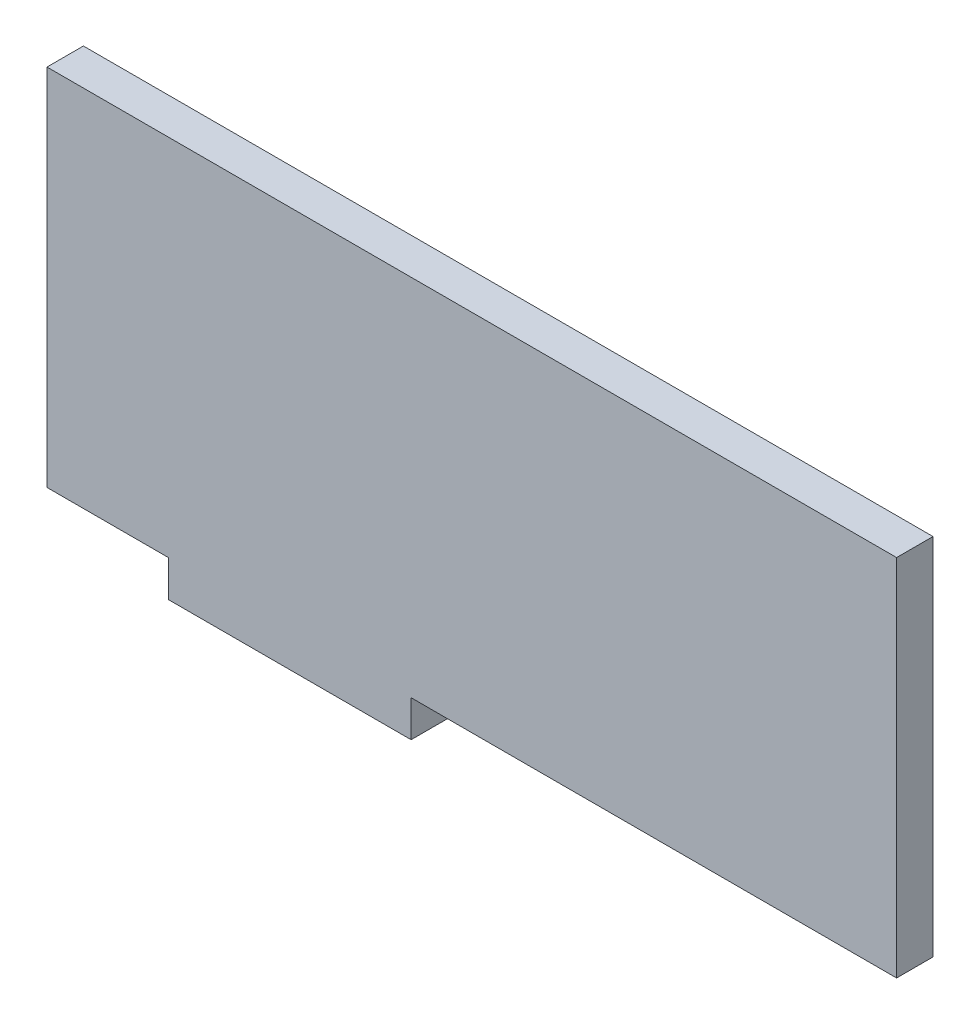
ISO-10303-21;
HEADER;
FILE_DESCRIPTION(('STEP AP214'),'2;1');
FILE_NAME('part.step','',(''),(''),'','','');
FILE_SCHEMA(('AUTOMOTIVE_DESIGN { 1 0 10303 214 1 1 1 1 }'));
ENDSEC;
DATA;
#1=APPLICATION_CONTEXT('core data for automotive mechanical design processes');
#2=APPLICATION_PROTOCOL_DEFINITION('international standard','automotive_design',2000,#1);
#3=PRODUCT_CONTEXT('',#1,'mechanical');
#4=PRODUCT('Part','Part','',(#3));
#5=PRODUCT_RELATED_PRODUCT_CATEGORY('part','',(#4));
#6=PRODUCT_DEFINITION_FORMATION('','',#4);
#7=PRODUCT_DEFINITION_CONTEXT('part definition',#1,'design');
#8=PRODUCT_DEFINITION('design','',#6,#7);
#9=PRODUCT_DEFINITION_SHAPE('','',#8);
#10=(LENGTH_UNIT() NAMED_UNIT(*) SI_UNIT(.MILLI.,.METRE.));
#11=(NAMED_UNIT(*) PLANE_ANGLE_UNIT() SI_UNIT($,.RADIAN.));
#12=(NAMED_UNIT(*) SI_UNIT($,.STERADIAN.) SOLID_ANGLE_UNIT());
#13=UNCERTAINTY_MEASURE_WITH_UNIT(LENGTH_MEASURE(1.E-05),#10,'distance_accuracy_value','');
#14=(GEOMETRIC_REPRESENTATION_CONTEXT(3) GLOBAL_UNCERTAINTY_ASSIGNED_CONTEXT((#13)) GLOBAL_UNIT_ASSIGNED_CONTEXT((#10,
#11,#12)) REPRESENTATION_CONTEXT('',''));
#15=CARTESIAN_POINT('',(0.,0.,0.));
#16=DIRECTION('',(0.,0.,1.));
#17=DIRECTION('',(1.,0.,0.));
#18=AXIS2_PLACEMENT_3D('',#15,#16,#17);
#19=CARTESIAN_POINT('',(0.,-3.00000000000001,3.));
#20=DIRECTION('',(1.,0.,0.));
#21=DIRECTION('',(0.,0.,-1.));
#22=AXIS2_PLACEMENT_3D('',#19,#20,#21);
#23=PLANE('',#22);
#24=DIRECTION('',(0.,-1.,0.));
#25=VECTOR('',#24,1.);
#26=CARTESIAN_POINT('',(0.,-3.00000000000001,0.));
#27=LINE('',#26,#25);
#28=CARTESIAN_POINT('',(0.,0.,0.));
#29=VERTEX_POINT('',#28);
#30=CARTESIAN_POINT('',(0.,-3.00000000000001,0.));
#31=VERTEX_POINT('',#30);
#32=EDGE_CURVE('E140',#29,#31,#27,.T.);
#33=ORIENTED_EDGE('',*,*,#32,.T.);
#34=DIRECTION('',(0.,0.,-1.));
#35=VECTOR('',#34,1.);
#36=CARTESIAN_POINT('',(0.,-3.00000000000001,3.));
#37=LINE('',#36,#35);
#38=CARTESIAN_POINT('',(0.,-3.00000000000001,3.));
#39=VERTEX_POINT('',#38);
#40=EDGE_CURVE('E11',#39,#31,#37,.T.);
#41=ORIENTED_EDGE('',*,*,#40,.F.);
#42=DIRECTION('',(0.,-1.,0.));
#43=VECTOR('',#42,1.);
#44=CARTESIAN_POINT('',(0.,-3.00000000000001,3.));
#45=LINE('',#44,#43);
#46=CARTESIAN_POINT('',(0.,0.,3.));
#47=VERTEX_POINT('',#46);
#48=EDGE_CURVE('E162',#47,#39,#45,.T.);
#49=ORIENTED_EDGE('',*,*,#48,.F.);
#50=DIRECTION('',(0.,0.,-1.));
#51=VECTOR('',#50,1.);
#52=CARTESIAN_POINT('',(0.,0.,3.));
#53=LINE('',#52,#51);
#54=EDGE_CURVE('E136',#47,#29,#53,.T.);
#55=ORIENTED_EDGE('',*,*,#54,.T.);
#56=EDGE_LOOP('',(#33,#41,#49,#55));
#57=FACE_BOUND('',#56,.T.);
#58=ADVANCED_FACE('F39',(#57),#23,.F.);
#59=CARTESIAN_POINT('',(20.,-3.00000000000001,3.));
#60=DIRECTION('',(0.,1.,0.));
#61=DIRECTION('',(-1.,0.,0.));
#62=AXIS2_PLACEMENT_3D('',#59,#60,#61);
#63=PLANE('',#62);
#64=DIRECTION('',(1.,0.,0.));
#65=VECTOR('',#64,1.);
#66=CARTESIAN_POINT('',(20.,-3.00000000000001,0.));
#67=LINE('',#66,#65);
#68=CARTESIAN_POINT('',(20.,-3.00000000000001,0.));
#69=VERTEX_POINT('',#68);
#70=EDGE_CURVE('E144',#31,#69,#67,.T.);
#71=ORIENTED_EDGE('',*,*,#70,.T.);
#72=DIRECTION('',(0.,0.,-1.));
#73=VECTOR('',#72,1.);
#74=CARTESIAN_POINT('',(20.,-3.00000000000001,3.));
#75=LINE('',#74,#73);
#76=CARTESIAN_POINT('',(20.,-3.00000000000001,3.));
#77=VERTEX_POINT('',#76);
#78=EDGE_CURVE('E48',#77,#69,#75,.T.);
#79=ORIENTED_EDGE('',*,*,#78,.F.);
#80=DIRECTION('',(1.,0.,0.));
#81=VECTOR('',#80,1.);
#82=CARTESIAN_POINT('',(20.,-3.00000000000001,3.));
#83=LINE('',#82,#81);
#84=EDGE_CURVE('E99',#39,#77,#83,.T.);
#85=ORIENTED_EDGE('',*,*,#84,.F.);
#86=ORIENTED_EDGE('',*,*,#40,.T.);
#87=EDGE_LOOP('',(#71,#79,#85,#86));
#88=FACE_BOUND('',#87,.T.);
#89=ADVANCED_FACE('F208',(#88),#63,.F.);
#90=CARTESIAN_POINT('',(20.,0.,3.));
#91=DIRECTION('',(-1.,0.,0.));
#92=DIRECTION('',(0.,-1.,0.));
#93=AXIS2_PLACEMENT_3D('',#90,#91,#92);
#94=PLANE('',#93);
#95=DIRECTION('',(0.,1.,0.));
#96=VECTOR('',#95,1.);
#97=CARTESIAN_POINT('',(20.,0.,0.));
#98=LINE('',#97,#96);
#99=CARTESIAN_POINT('',(20.,0.,0.));
#100=VERTEX_POINT('',#99);
#101=EDGE_CURVE('E147',#69,#100,#98,.T.);
#102=ORIENTED_EDGE('',*,*,#101,.T.);
#103=DIRECTION('',(0.,0.,-1.));
#104=VECTOR('',#103,1.);
#105=CARTESIAN_POINT('',(20.,0.,3.));
#106=LINE('',#105,#104);
#107=CARTESIAN_POINT('',(20.,0.,3.));
#108=VERTEX_POINT('',#107);
#109=EDGE_CURVE('E173',#108,#100,#106,.T.);
#110=ORIENTED_EDGE('',*,*,#109,.F.);
#111=DIRECTION('',(0.,1.,0.));
#112=VECTOR('',#111,1.);
#113=CARTESIAN_POINT('',(20.,0.,3.));
#114=LINE('',#113,#112);
#115=EDGE_CURVE('E183',#77,#108,#114,.T.);
#116=ORIENTED_EDGE('',*,*,#115,.F.);
#117=ORIENTED_EDGE('',*,*,#78,.T.);
#118=EDGE_LOOP('',(#102,#110,#116,#117));
#119=FACE_BOUND('',#118,.T.);
#120=ADVANCED_FACE('F181',(#119),#94,.F.);
#121=CARTESIAN_POINT('',(60.,0.,3.));
#122=DIRECTION('',(0.,1.,0.));
#123=DIRECTION('',(-1.,0.,0.));
#124=AXIS2_PLACEMENT_3D('',#121,#122,#123);
#125=PLANE('',#124);
#126=DIRECTION('',(1.,0.,0.));
#127=VECTOR('',#126,1.);
#128=CARTESIAN_POINT('',(60.,0.,0.));
#129=LINE('',#128,#127);
#130=CARTESIAN_POINT('',(60.,0.,0.));
#131=VERTEX_POINT('',#130);
#132=EDGE_CURVE('E150',#100,#131,#129,.T.);
#133=ORIENTED_EDGE('',*,*,#132,.T.);
#134=DIRECTION('',(0.,0.,-1.));
#135=VECTOR('',#134,1.);
#136=CARTESIAN_POINT('',(60.,0.,3.));
#137=LINE('',#136,#135);
#138=CARTESIAN_POINT('',(60.,0.,3.));
#139=VERTEX_POINT('',#138);
#140=EDGE_CURVE('E169',#139,#131,#137,.T.);
#141=ORIENTED_EDGE('',*,*,#140,.F.);
#142=DIRECTION('',(1.,0.,0.));
#143=VECTOR('',#142,1.);
#144=CARTESIAN_POINT('',(60.,0.,3.));
#145=LINE('',#144,#143);
#146=EDGE_CURVE('E196',#108,#139,#145,.T.);
#147=ORIENTED_EDGE('',*,*,#146,.F.);
#148=ORIENTED_EDGE('',*,*,#109,.T.);
#149=EDGE_LOOP('',(#133,#141,#147,#148));
#150=FACE_BOUND('',#149,.T.);
#151=ADVANCED_FACE('F191',(#150),#125,.F.);
#152=CARTESIAN_POINT('',(60.,30.,3.));
#153=DIRECTION('',(-1.,0.,0.));
#154=DIRECTION('',(0.,-1.,0.));
#155=AXIS2_PLACEMENT_3D('',#152,#153,#154);
#156=PLANE('',#155);
#157=DIRECTION('',(0.,1.,0.));
#158=VECTOR('',#157,1.);
#159=CARTESIAN_POINT('',(60.,30.,0.));
#160=LINE('',#159,#158);
#161=CARTESIAN_POINT('',(60.,30.,0.));
#162=VERTEX_POINT('',#161);
#163=EDGE_CURVE('E153',#131,#162,#160,.T.);
#164=ORIENTED_EDGE('',*,*,#163,.T.);
#165=DIRECTION('',(0.,0.,-1.));
#166=VECTOR('',#165,1.);
#167=CARTESIAN_POINT('',(60.,30.,3.));
#168=LINE('',#167,#166);
#169=CARTESIAN_POINT('',(60.,30.,3.));
#170=VERTEX_POINT('',#169);
#171=EDGE_CURVE('E129',#170,#162,#168,.T.);
#172=ORIENTED_EDGE('',*,*,#171,.F.);
#173=DIRECTION('',(0.,1.,0.));
#174=VECTOR('',#173,1.);
#175=CARTESIAN_POINT('',(60.,30.,3.));
#176=LINE('',#175,#174);
#177=EDGE_CURVE('E118',#139,#170,#176,.T.);
#178=ORIENTED_EDGE('',*,*,#177,.F.);
#179=ORIENTED_EDGE('',*,*,#140,.T.);
#180=EDGE_LOOP('',(#164,#172,#178,#179));
#181=FACE_BOUND('',#180,.T.);
#182=ADVANCED_FACE('F194',(#181),#156,.F.);
#183=CARTESIAN_POINT('',(-10.,30.,3.));
#184=DIRECTION('',(0.,-1.,0.));
#185=DIRECTION('',(1.,0.,0.));
#186=AXIS2_PLACEMENT_3D('',#183,#184,#185);
#187=PLANE('',#186);
#188=DIRECTION('',(-1.,0.,0.));
#189=VECTOR('',#188,1.);
#190=CARTESIAN_POINT('',(-10.,30.,0.));
#191=LINE('',#190,#189);
#192=CARTESIAN_POINT('',(-10.,30.,0.));
#193=VERTEX_POINT('',#192);
#194=EDGE_CURVE('E127',#162,#193,#191,.T.);
#195=ORIENTED_EDGE('',*,*,#194,.T.);
#196=DIRECTION('',(0.,0.,-1.));
#197=VECTOR('',#196,1.);
#198=CARTESIAN_POINT('',(-10.,30.,3.));
#199=LINE('',#198,#197);
#200=CARTESIAN_POINT('',(-10.,30.,3.));
#201=VERTEX_POINT('',#200);
#202=EDGE_CURVE('E124',#201,#193,#199,.T.);
#203=ORIENTED_EDGE('',*,*,#202,.F.);
#204=DIRECTION('',(-1.,0.,0.));
#205=VECTOR('',#204,1.);
#206=CARTESIAN_POINT('',(-10.,30.,3.));
#207=LINE('',#206,#205);
#208=EDGE_CURVE('E112',#170,#201,#207,.T.);
#209=ORIENTED_EDGE('',*,*,#208,.F.);
#210=ORIENTED_EDGE('',*,*,#171,.T.);
#211=EDGE_LOOP('',(#195,#203,#209,#210));
#212=FACE_BOUND('',#211,.T.);
#213=ADVANCED_FACE('F125',(#212),#187,.F.);
#214=CARTESIAN_POINT('',(-10.,0.,3.));
#215=DIRECTION('',(1.,0.,0.));
#216=DIRECTION('',(0.,0.,-1.));
#217=AXIS2_PLACEMENT_3D('',#214,#215,#216);
#218=PLANE('',#217);
#219=DIRECTION('',(0.,-1.,0.));
#220=VECTOR('',#219,1.);
#221=CARTESIAN_POINT('',(-10.,0.,0.));
#222=LINE('',#221,#220);
#223=CARTESIAN_POINT('',(-10.,0.,0.));
#224=VERTEX_POINT('',#223);
#225=EDGE_CURVE('E85',#193,#224,#222,.T.);
#226=ORIENTED_EDGE('',*,*,#225,.T.);
#227=DIRECTION('',(0.,0.,-1.));
#228=VECTOR('',#227,1.);
#229=CARTESIAN_POINT('',(-10.,0.,3.));
#230=LINE('',#229,#228);
#231=CARTESIAN_POINT('',(-10.,0.,3.));
#232=VERTEX_POINT('',#231);
#233=EDGE_CURVE('E130',#232,#224,#230,.T.);
#234=ORIENTED_EDGE('',*,*,#233,.F.);
#235=DIRECTION('',(0.,-1.,0.));
#236=VECTOR('',#235,1.);
#237=CARTESIAN_POINT('',(-10.,0.,3.));
#238=LINE('',#237,#236);
#239=EDGE_CURVE('E116',#201,#232,#238,.T.);
#240=ORIENTED_EDGE('',*,*,#239,.F.);
#241=ORIENTED_EDGE('',*,*,#202,.T.);
#242=EDGE_LOOP('',(#226,#234,#240,#241));
#243=FACE_BOUND('',#242,.T.);
#244=ADVANCED_FACE('F132',(#243),#218,.F.);
#245=CARTESIAN_POINT('',(0.,0.,3.));
#246=DIRECTION('',(0.,1.,0.));
#247=DIRECTION('',(-1.,0.,0.));
#248=AXIS2_PLACEMENT_3D('',#245,#246,#247);
#249=PLANE('',#248);
#250=DIRECTION('',(1.,0.,0.));
#251=VECTOR('',#250,1.);
#252=CARTESIAN_POINT('',(0.,0.,0.));
#253=LINE('',#252,#251);
#254=EDGE_CURVE('E91',#224,#29,#253,.T.);
#255=ORIENTED_EDGE('',*,*,#254,.T.);
#256=ORIENTED_EDGE('',*,*,#54,.F.);
#257=DIRECTION('',(1.,0.,0.));
#258=VECTOR('',#257,1.);
#259=CARTESIAN_POINT('',(0.,0.,3.));
#260=LINE('',#259,#258);
#261=EDGE_CURVE('E56',#232,#47,#260,.T.);
#262=ORIENTED_EDGE('',*,*,#261,.F.);
#263=ORIENTED_EDGE('',*,*,#233,.T.);
#264=EDGE_LOOP('',(#255,#256,#262,#263));
#265=FACE_BOUND('',#264,.T.);
#266=ADVANCED_FACE('F224',(#265),#249,.F.);
#267=CARTESIAN_POINT('',(0.,0.,3.));
#268=DIRECTION('',(0.,0.,1.));
#269=DIRECTION('',(1.,0.,0.));
#270=AXIS2_PLACEMENT_3D('',#267,#268,#269);
#271=PLANE('',#270);
#272=ORIENTED_EDGE('',*,*,#48,.T.);
#273=ORIENTED_EDGE('',*,*,#84,.T.);
#274=ORIENTED_EDGE('',*,*,#115,.T.);
#275=ORIENTED_EDGE('',*,*,#146,.T.);
#276=ORIENTED_EDGE('',*,*,#177,.T.);
#277=ORIENTED_EDGE('',*,*,#208,.T.);
#278=ORIENTED_EDGE('',*,*,#239,.T.);
#279=ORIENTED_EDGE('',*,*,#261,.T.);
#280=EDGE_LOOP('',(#272,#273,#274,#275,#276,#277,#278,#279));
#281=FACE_BOUND('',#280,.T.);
#282=ADVANCED_FACE('F114',(#281),#271,.T.);
#283=CARTESIAN_POINT('',(0.,0.,0.));
#284=DIRECTION('',(0.,0.,1.));
#285=DIRECTION('',(1.,0.,0.));
#286=AXIS2_PLACEMENT_3D('',#283,#284,#285);
#287=PLANE('',#286);
#288=ORIENTED_EDGE('',*,*,#32,.F.);
#289=ORIENTED_EDGE('',*,*,#254,.F.);
#290=ORIENTED_EDGE('',*,*,#225,.F.);
#291=ORIENTED_EDGE('',*,*,#194,.F.);
#292=ORIENTED_EDGE('',*,*,#163,.F.);
#293=ORIENTED_EDGE('',*,*,#132,.F.);
#294=ORIENTED_EDGE('',*,*,#101,.F.);
#295=ORIENTED_EDGE('',*,*,#70,.F.);
#296=EDGE_LOOP('',(#288,#289,#290,#291,#292,#293,#294,#295));
#297=FACE_BOUND('',#296,.T.);
#298=ADVANCED_FACE('F187',(#297),#287,.F.);
#299=CLOSED_SHELL('',(#58,#89,#120,#151,#182,#213,#244,#266,#282,#298));
#300=MANIFOLD_SOLID_BREP('B2',#299);
#301=ADVANCED_BREP_SHAPE_REPRESENTATION('',(#18,#300),#14);
#302=SHAPE_DEFINITION_REPRESENTATION(#9,#301);
ENDSEC;
END-ISO-10303-21;
